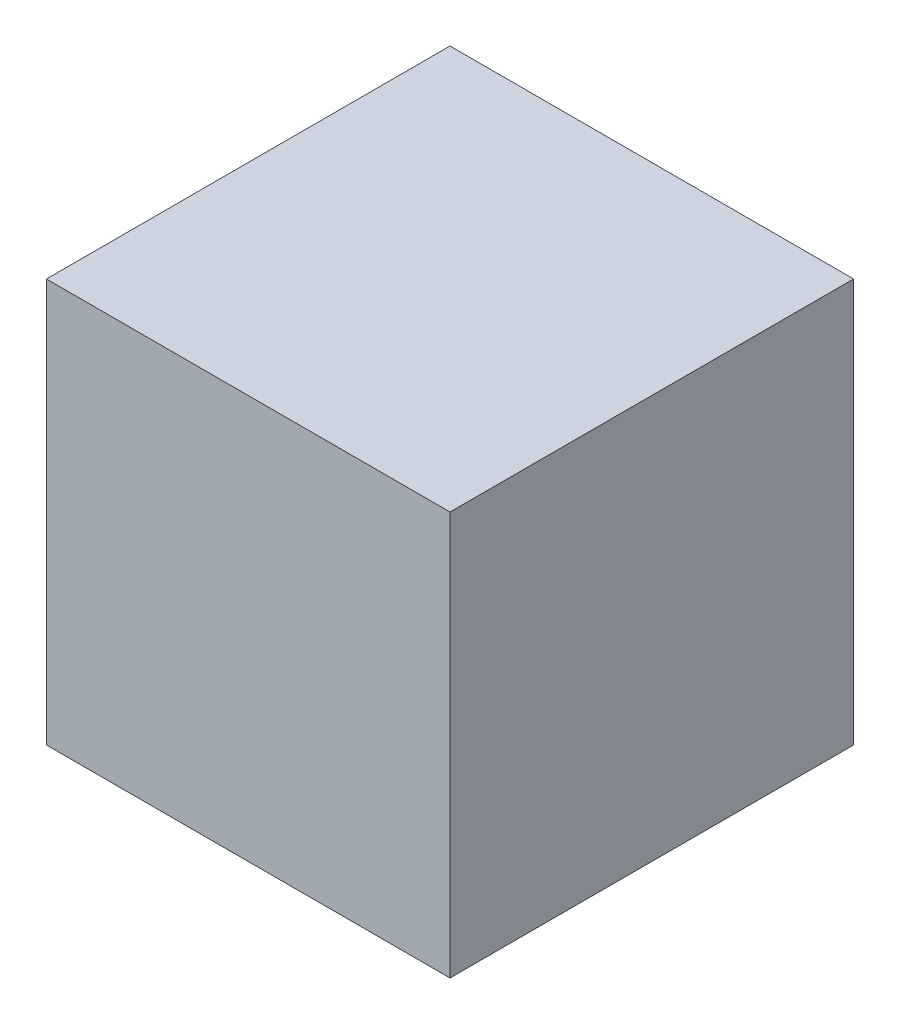
ISO-10303-21;
HEADER;
FILE_DESCRIPTION(('STEP AP214'),'2;1');
FILE_NAME('part.step','',(''),(''),'','','');
FILE_SCHEMA(('AUTOMOTIVE_DESIGN { 1 0 10303 214 1 1 1 1 }'));
ENDSEC;
DATA;
#1=APPLICATION_CONTEXT('core data for automotive mechanical design processes');
#2=APPLICATION_PROTOCOL_DEFINITION('international standard','automotive_design',2000,#1);
#3=PRODUCT_CONTEXT('',#1,'mechanical');
#4=PRODUCT('Part','Part','',(#3));
#5=PRODUCT_RELATED_PRODUCT_CATEGORY('part','',(#4));
#6=PRODUCT_DEFINITION_FORMATION('','',#4);
#7=PRODUCT_DEFINITION_CONTEXT('part definition',#1,'design');
#8=PRODUCT_DEFINITION('design','',#6,#7);
#9=PRODUCT_DEFINITION_SHAPE('','',#8);
#10=(LENGTH_UNIT() NAMED_UNIT(*) SI_UNIT(.MILLI.,.METRE.));
#11=(NAMED_UNIT(*) PLANE_ANGLE_UNIT() SI_UNIT($,.RADIAN.));
#12=(NAMED_UNIT(*) SI_UNIT($,.STERADIAN.) SOLID_ANGLE_UNIT());
#13=UNCERTAINTY_MEASURE_WITH_UNIT(LENGTH_MEASURE(1.E-05),#10,'distance_accuracy_value','');
#14=(GEOMETRIC_REPRESENTATION_CONTEXT(3) GLOBAL_UNCERTAINTY_ASSIGNED_CONTEXT((#13)) GLOBAL_UNIT_ASSIGNED_CONTEXT((#10,
#11,#12)) REPRESENTATION_CONTEXT('',''));
#15=CARTESIAN_POINT('',(0.,0.,0.));
#16=DIRECTION('',(0.,0.,1.));
#17=DIRECTION('',(1.,0.,0.));
#18=AXIS2_PLACEMENT_3D('',#15,#16,#17);
#19=CARTESIAN_POINT('',(-30.5,-30.5,61.));
#20=DIRECTION('',(1.,0.,0.));
#21=DIRECTION('',(0.,0.,-1.));
#22=AXIS2_PLACEMENT_3D('',#19,#20,#21);
#23=PLANE('',#22);
#24=DIRECTION('',(0.,-1.,0.));
#25=VECTOR('',#24,1.);
#26=CARTESIAN_POINT('',(-30.5,-30.5,0.));
#27=LINE('',#26,#25);
#28=CARTESIAN_POINT('',(-30.5,30.5,0.));
#29=VERTEX_POINT('',#28);
#30=CARTESIAN_POINT('',(-30.5,-30.5,0.));
#31=VERTEX_POINT('',#30);
#32=EDGE_CURVE('E95',#29,#31,#27,.T.);
#33=ORIENTED_EDGE('',*,*,#32,.T.);
#34=DIRECTION('',(0.,0.,-1.));
#35=VECTOR('',#34,1.);
#36=CARTESIAN_POINT('',(-30.5,-30.5,61.));
#37=LINE('',#36,#35);
#38=CARTESIAN_POINT('',(-30.5,-30.5,61.));
#39=VERTEX_POINT('',#38);
#40=EDGE_CURVE('E11',#39,#31,#37,.T.);
#41=ORIENTED_EDGE('',*,*,#40,.F.);
#42=DIRECTION('',(0.,-1.,0.));
#43=VECTOR('',#42,1.);
#44=CARTESIAN_POINT('',(-30.5,-30.5,61.));
#45=LINE('',#44,#43);
#46=CARTESIAN_POINT('',(-30.5,30.5,61.));
#47=VERTEX_POINT('',#46);
#48=EDGE_CURVE('E83',#47,#39,#45,.T.);
#49=ORIENTED_EDGE('',*,*,#48,.F.);
#50=DIRECTION('',(0.,0.,-1.));
#51=VECTOR('',#50,1.);
#52=CARTESIAN_POINT('',(-30.5,30.5,61.));
#53=LINE('',#52,#51);
#54=EDGE_CURVE('E91',#47,#29,#53,.T.);
#55=ORIENTED_EDGE('',*,*,#54,.T.);
#56=EDGE_LOOP('',(#33,#41,#49,#55));
#57=FACE_BOUND('',#56,.T.);
#58=ADVANCED_FACE('F32',(#57),#23,.F.);
#59=CARTESIAN_POINT('',(30.5,-30.5,61.));
#60=DIRECTION('',(0.,1.,0.));
#61=DIRECTION('',(-1.,0.,0.));
#62=AXIS2_PLACEMENT_3D('',#59,#60,#61);
#63=PLANE('',#62);
#64=DIRECTION('',(1.,0.,0.));
#65=VECTOR('',#64,1.);
#66=CARTESIAN_POINT('',(30.5,-30.5,0.));
#67=LINE('',#66,#65);
#68=CARTESIAN_POINT('',(30.5,-30.5,0.));
#69=VERTEX_POINT('',#68);
#70=EDGE_CURVE('E87',#31,#69,#67,.T.);
#71=ORIENTED_EDGE('',*,*,#70,.T.);
#72=DIRECTION('',(0.,0.,-1.));
#73=VECTOR('',#72,1.);
#74=CARTESIAN_POINT('',(30.5,-30.5,61.));
#75=LINE('',#74,#73);
#76=CARTESIAN_POINT('',(30.5,-30.5,61.));
#77=VERTEX_POINT('',#76);
#78=EDGE_CURVE('E40',#77,#69,#75,.T.);
#79=ORIENTED_EDGE('',*,*,#78,.F.);
#80=DIRECTION('',(1.,0.,0.));
#81=VECTOR('',#80,1.);
#82=CARTESIAN_POINT('',(30.5,-30.5,61.));
#83=LINE('',#82,#81);
#84=EDGE_CURVE('E78',#39,#77,#83,.T.);
#85=ORIENTED_EDGE('',*,*,#84,.F.);
#86=ORIENTED_EDGE('',*,*,#40,.T.);
#87=EDGE_LOOP('',(#71,#79,#85,#86));
#88=FACE_BOUND('',#87,.T.);
#89=ADVANCED_FACE('F86',(#88),#63,.F.);
#90=CARTESIAN_POINT('',(30.5,-30.5,61.));
#91=DIRECTION('',(-1.,0.,0.));
#92=DIRECTION('',(0.,0.,1.));
#93=AXIS2_PLACEMENT_3D('',#90,#91,#92);
#94=PLANE('',#93);
#95=DIRECTION('',(0.,1.,0.));
#96=VECTOR('',#95,1.);
#97=CARTESIAN_POINT('',(30.5,-30.5,0.));
#98=LINE('',#97,#96);
#99=CARTESIAN_POINT('',(30.5,30.5,0.));
#100=VERTEX_POINT('',#99);
#101=EDGE_CURVE('E65',#69,#100,#98,.T.);
#102=ORIENTED_EDGE('',*,*,#101,.T.);
#103=DIRECTION('',(0.,0.,-1.));
#104=VECTOR('',#103,1.);
#105=CARTESIAN_POINT('',(30.5,30.5,61.));
#106=LINE('',#105,#104);
#107=CARTESIAN_POINT('',(30.5,30.5,61.));
#108=VERTEX_POINT('',#107);
#109=EDGE_CURVE('E88',#108,#100,#106,.T.);
#110=ORIENTED_EDGE('',*,*,#109,.F.);
#111=DIRECTION('',(0.,1.,0.));
#112=VECTOR('',#111,1.);
#113=CARTESIAN_POINT('',(30.5,-30.5,61.));
#114=LINE('',#113,#112);
#115=EDGE_CURVE('E81',#77,#108,#114,.T.);
#116=ORIENTED_EDGE('',*,*,#115,.F.);
#117=ORIENTED_EDGE('',*,*,#78,.T.);
#118=EDGE_LOOP('',(#102,#110,#116,#117));
#119=FACE_BOUND('',#118,.T.);
#120=ADVANCED_FACE('F89',(#119),#94,.F.);
#121=CARTESIAN_POINT('',(30.5,30.5,61.));
#122=DIRECTION('',(0.,-1.,0.));
#123=DIRECTION('',(1.,0.,0.));
#124=AXIS2_PLACEMENT_3D('',#121,#122,#123);
#125=PLANE('',#124);
#126=DIRECTION('',(-1.,0.,0.));
#127=VECTOR('',#126,1.);
#128=CARTESIAN_POINT('',(30.5,30.5,0.));
#129=LINE('',#128,#127);
#130=EDGE_CURVE('E71',#100,#29,#129,.T.);
#131=ORIENTED_EDGE('',*,*,#130,.T.);
#132=ORIENTED_EDGE('',*,*,#54,.F.);
#133=DIRECTION('',(-1.,0.,0.));
#134=VECTOR('',#133,1.);
#135=CARTESIAN_POINT('',(30.5,30.5,61.));
#136=LINE('',#135,#134);
#137=EDGE_CURVE('E48',#108,#47,#136,.T.);
#138=ORIENTED_EDGE('',*,*,#137,.F.);
#139=ORIENTED_EDGE('',*,*,#109,.T.);
#140=EDGE_LOOP('',(#131,#132,#138,#139));
#141=FACE_BOUND('',#140,.T.);
#142=ADVANCED_FACE('F102',(#141),#125,.F.);
#143=CARTESIAN_POINT('',(0.,0.,61.));
#144=DIRECTION('',(0.,0.,1.));
#145=DIRECTION('',(1.,0.,0.));
#146=AXIS2_PLACEMENT_3D('',#143,#144,#145);
#147=PLANE('',#146);
#148=ORIENTED_EDGE('',*,*,#48,.T.);
#149=ORIENTED_EDGE('',*,*,#84,.T.);
#150=ORIENTED_EDGE('',*,*,#115,.T.);
#151=ORIENTED_EDGE('',*,*,#137,.T.);
#152=EDGE_LOOP('',(#148,#149,#150,#151));
#153=FACE_BOUND('',#152,.T.);
#154=ADVANCED_FACE('F79',(#153),#147,.T.);
#155=CARTESIAN_POINT('',(0.,0.,0.));
#156=DIRECTION('',(0.,0.,1.));
#157=DIRECTION('',(1.,0.,0.));
#158=AXIS2_PLACEMENT_3D('',#155,#156,#157);
#159=PLANE('',#158);
#160=ORIENTED_EDGE('',*,*,#32,.F.);
#161=ORIENTED_EDGE('',*,*,#130,.F.);
#162=ORIENTED_EDGE('',*,*,#101,.F.);
#163=ORIENTED_EDGE('',*,*,#70,.F.);
#164=EDGE_LOOP('',(#160,#161,#162,#163));
#165=FACE_BOUND('',#164,.T.);
#166=ADVANCED_FACE('F105',(#165),#159,.F.);
#167=CLOSED_SHELL('',(#58,#89,#120,#142,#154,#166));
#168=MANIFOLD_SOLID_BREP('B2',#167);
#169=ADVANCED_BREP_SHAPE_REPRESENTATION('',(#18,#168),#14);
#170=SHAPE_DEFINITION_REPRESENTATION(#9,#169);
ENDSEC;
END-ISO-10303-21;
